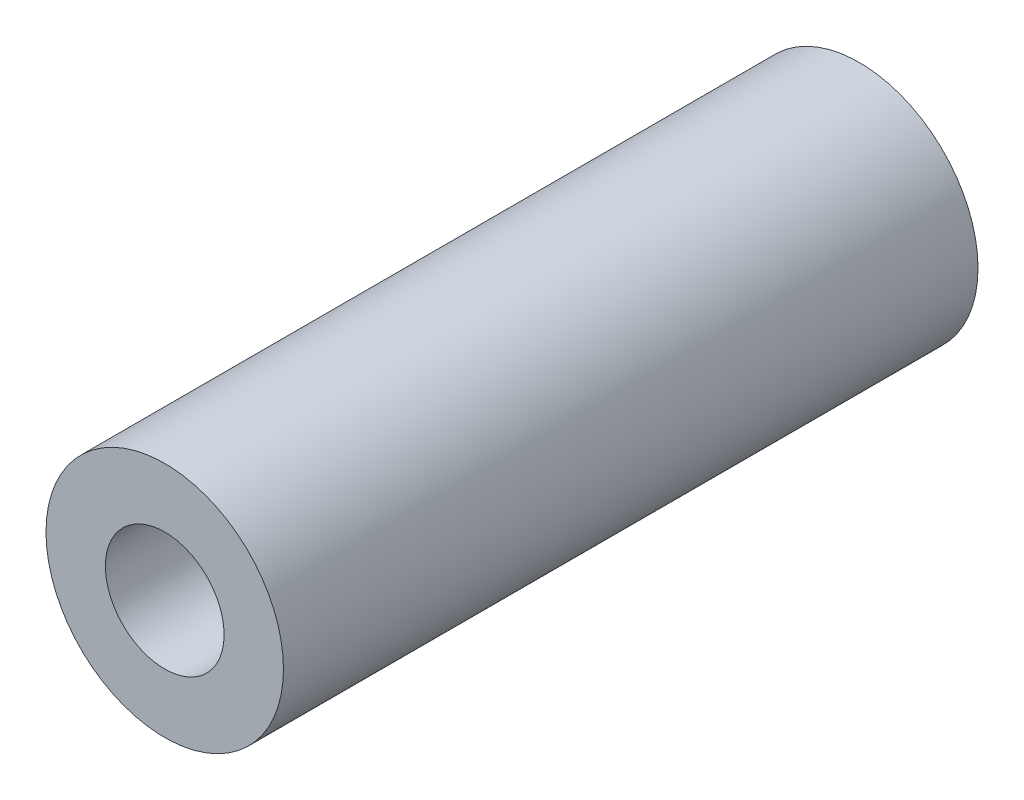
ISO-10303-21;
HEADER;
FILE_DESCRIPTION(('STEP AP214'),'2;1');
FILE_NAME('part.step','',(''),(''),'','','');
FILE_SCHEMA(('AUTOMOTIVE_DESIGN { 1 0 10303 214 1 1 1 1 }'));
ENDSEC;
DATA;
#1=APPLICATION_CONTEXT('core data for automotive mechanical design processes');
#2=APPLICATION_PROTOCOL_DEFINITION('international standard','automotive_design',2000,#1);
#3=PRODUCT_CONTEXT('',#1,'mechanical');
#4=PRODUCT('Part','Part','',(#3));
#5=PRODUCT_RELATED_PRODUCT_CATEGORY('part','',(#4));
#6=PRODUCT_DEFINITION_FORMATION('','',#4);
#7=PRODUCT_DEFINITION_CONTEXT('part definition',#1,'design');
#8=PRODUCT_DEFINITION('design','',#6,#7);
#9=PRODUCT_DEFINITION_SHAPE('','',#8);
#10=(LENGTH_UNIT() NAMED_UNIT(*) SI_UNIT(.MILLI.,.METRE.));
#11=(NAMED_UNIT(*) PLANE_ANGLE_UNIT() SI_UNIT($,.RADIAN.));
#12=(NAMED_UNIT(*) SI_UNIT($,.STERADIAN.) SOLID_ANGLE_UNIT());
#13=UNCERTAINTY_MEASURE_WITH_UNIT(LENGTH_MEASURE(1.E-05),#10,'distance_accuracy_value','');
#14=(GEOMETRIC_REPRESENTATION_CONTEXT(3) GLOBAL_UNCERTAINTY_ASSIGNED_CONTEXT((#13)) GLOBAL_UNIT_ASSIGNED_CONTEXT((#10,
#11,#12)) REPRESENTATION_CONTEXT('',''));
#15=CARTESIAN_POINT('',(0.,0.,0.));
#16=DIRECTION('',(0.,0.,1.));
#17=DIRECTION('',(1.,0.,0.));
#18=AXIS2_PLACEMENT_3D('',#15,#16,#17);
#19=CARTESIAN_POINT('',(0.,0.,-17.3568542494924));
#20=DIRECTION('',(0.,0.,1.));
#21=DIRECTION('',(1.,0.,0.));
#22=AXIS2_PLACEMENT_3D('',#19,#20,#21);
#23=CYLINDRICAL_SURFACE('',#22,2.);
#24=CARTESIAN_POINT('',(0.,0.,0.));
#25=DIRECTION('',(0.,0.,1.));
#26=DIRECTION('',(1.,0.,0.));
#27=AXIS2_PLACEMENT_3D('',#24,#25,#26);
#28=CIRCLE('',#27,2.);
#29=CARTESIAN_POINT('',(2.,0.,0.));
#30=VERTEX_POINT('',#29);
#31=EDGE_CURVE('E36',#30,#30,#28,.T.);
#32=ORIENTED_EDGE('',*,*,#31,.F.);
#33=EDGE_LOOP('',(#32));
#34=FACE_BOUND('',#33,.T.);
#35=CARTESIAN_POINT('',(0.,0.,-11.7));
#36=DIRECTION('',(0.,0.,1.));
#37=DIRECTION('',(1.,0.,0.));
#38=AXIS2_PLACEMENT_3D('',#35,#36,#37);
#39=CIRCLE('',#38,2.);
#40=CARTESIAN_POINT('',(2.,0.,-11.7));
#41=VERTEX_POINT('',#40);
#42=EDGE_CURVE('E10',#41,#41,#39,.T.);
#43=ORIENTED_EDGE('',*,*,#42,.T.);
#44=EDGE_LOOP('',(#43));
#45=FACE_BOUND('',#44,.T.);
#46=ADVANCED_FACE('F33',(#34,#45),#23,.T.);
#47=CARTESIAN_POINT('',(0.,0.,-17.3568542494924));
#48=DIRECTION('',(0.,0.,1.));
#49=DIRECTION('',(1.,0.,0.));
#50=AXIS2_PLACEMENT_3D('',#47,#48,#49);
#51=CYLINDRICAL_SURFACE('',#50,1.);
#52=CARTESIAN_POINT('',(0.,0.,0.));
#53=DIRECTION('',(0.,0.,1.));
#54=DIRECTION('',(1.,0.,0.));
#55=AXIS2_PLACEMENT_3D('',#52,#53,#54);
#56=CIRCLE('',#55,1.);
#57=CARTESIAN_POINT('',(1.,0.,0.));
#58=VERTEX_POINT('',#57);
#59=EDGE_CURVE('E46',#58,#58,#56,.T.);
#60=ORIENTED_EDGE('',*,*,#59,.T.);
#61=EDGE_LOOP('',(#60));
#62=FACE_BOUND('',#61,.T.);
#63=CARTESIAN_POINT('',(0.,0.,-11.7));
#64=DIRECTION('',(0.,0.,1.));
#65=DIRECTION('',(1.,0.,0.));
#66=AXIS2_PLACEMENT_3D('',#63,#64,#65);
#67=CIRCLE('',#66,0.999999999999998);
#68=CARTESIAN_POINT('',(0.999999999999998,0.,-11.7));
#69=VERTEX_POINT('',#68);
#70=EDGE_CURVE('E40',#69,#69,#67,.T.);
#71=ORIENTED_EDGE('',*,*,#70,.F.);
#72=EDGE_LOOP('',(#71));
#73=FACE_BOUND('',#72,.T.);
#74=ADVANCED_FACE('F56',(#62,#73),#51,.F.);
#75=CARTESIAN_POINT('',(0.,0.,0.));
#76=DIRECTION('',(0.,0.,1.));
#77=DIRECTION('',(1.,0.,0.));
#78=AXIS2_PLACEMENT_3D('',#75,#76,#77);
#79=PLANE('',#78);
#80=ORIENTED_EDGE('',*,*,#59,.F.);
#81=EDGE_LOOP('',(#80));
#82=FACE_BOUND('',#81,.T.);
#83=ORIENTED_EDGE('',*,*,#31,.T.);
#84=EDGE_LOOP('',(#83));
#85=FACE_BOUND('',#84,.T.);
#86=ADVANCED_FACE('F53',(#82,#85),#79,.T.);
#87=CARTESIAN_POINT('',(-2.,0.,-11.7));
#88=DIRECTION('',(0.,0.,-1.));
#89=DIRECTION('',(-1.,0.,0.));
#90=AXIS2_PLACEMENT_3D('',#87,#88,#89);
#91=PLANE('',#90);
#92=ORIENTED_EDGE('',*,*,#70,.T.);
#93=EDGE_LOOP('',(#92));
#94=FACE_BOUND('',#93,.T.);
#95=ORIENTED_EDGE('',*,*,#42,.F.);
#96=EDGE_LOOP('',(#95));
#97=FACE_BOUND('',#96,.T.);
#98=ADVANCED_FACE('F64',(#94,#97),#91,.T.);
#99=CLOSED_SHELL('',(#46,#74,#86,#98));
#100=MANIFOLD_SOLID_BREP('B2',#99);
#101=ADVANCED_BREP_SHAPE_REPRESENTATION('',(#18,#100),#14);
#102=SHAPE_DEFINITION_REPRESENTATION(#9,#101);
ENDSEC;
END-ISO-10303-21;
